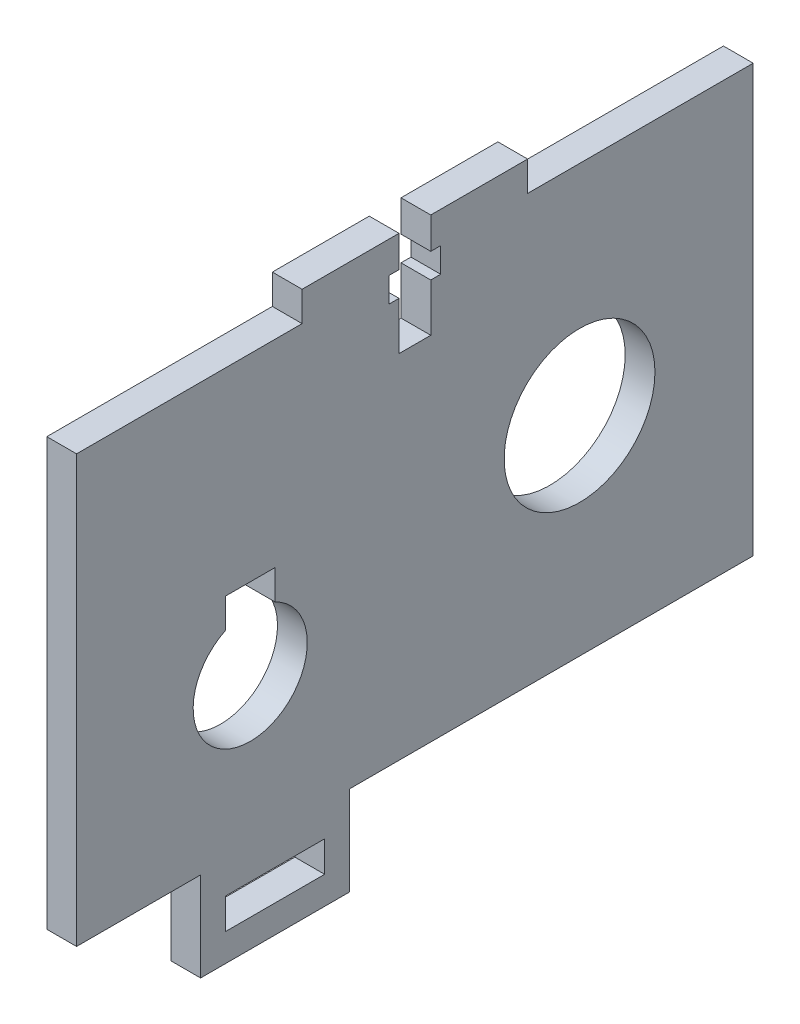
ISO-10303-21;
HEADER;
FILE_DESCRIPTION(('STEP AP214'),'2;1');
FILE_NAME('part.step','',(''),(''),'','','');
FILE_SCHEMA(('AUTOMOTIVE_DESIGN { 1 0 10303 214 1 1 1 1 }'));
ENDSEC;
DATA;
#1=APPLICATION_CONTEXT('core data for automotive mechanical design processes');
#2=APPLICATION_PROTOCOL_DEFINITION('international standard','automotive_design',2000,#1);
#3=PRODUCT_CONTEXT('',#1,'mechanical');
#4=PRODUCT('Part','Part','',(#3));
#5=PRODUCT_RELATED_PRODUCT_CATEGORY('part','',(#4));
#6=PRODUCT_DEFINITION_FORMATION('','',#4);
#7=PRODUCT_DEFINITION_CONTEXT('part definition',#1,'design');
#8=PRODUCT_DEFINITION('design','',#6,#7);
#9=PRODUCT_DEFINITION_SHAPE('','',#8);
#10=(LENGTH_UNIT() NAMED_UNIT(*) SI_UNIT(.MILLI.,.METRE.));
#11=(NAMED_UNIT(*) PLANE_ANGLE_UNIT() SI_UNIT($,.RADIAN.));
#12=(NAMED_UNIT(*) SI_UNIT($,.STERADIAN.) SOLID_ANGLE_UNIT());
#13=UNCERTAINTY_MEASURE_WITH_UNIT(LENGTH_MEASURE(1.E-05),#10,'distance_accuracy_value','');
#14=(GEOMETRIC_REPRESENTATION_CONTEXT(3) GLOBAL_UNCERTAINTY_ASSIGNED_CONTEXT((#13)) GLOBAL_UNIT_ASSIGNED_CONTEXT((#10,
#11,#12)) REPRESENTATION_CONTEXT('',''));
#15=CARTESIAN_POINT('',(0.,0.,0.));
#16=DIRECTION('',(0.,0.,1.));
#17=DIRECTION('',(1.,0.,0.));
#18=AXIS2_PLACEMENT_3D('',#15,#16,#17);
#19=CARTESIAN_POINT('',(3.,46.,0.));
#20=DIRECTION('',(0.,1.,0.));
#21=DIRECTION('',(0.,0.,1.));
#22=AXIS2_PLACEMENT_3D('',#19,#20,#21);
#23=PLANE('',#22);
#24=DIRECTION('',(0.,0.,-1.));
#25=VECTOR('',#24,1.);
#26=CARTESIAN_POINT('',(0.,46.,0.));
#27=LINE('',#26,#25);
#28=CARTESIAN_POINT('',(0.,46.,-35.6968796401613));
#29=VERTEX_POINT('',#28);
#30=CARTESIAN_POINT('',(0.,46.,-45.4625061868818));
#31=VERTEX_POINT('',#30);
#32=EDGE_CURVE('E465',#29,#31,#27,.T.);
#33=ORIENTED_EDGE('',*,*,#32,.F.);
#34=DIRECTION('',(1.,0.,0.));
#35=VECTOR('',#34,1.);
#36=CARTESIAN_POINT('',(0.,46.,-35.6968796401613));
#37=LINE('',#36,#35);
#38=CARTESIAN_POINT('',(3.,46.,-35.6968796401613));
#39=VERTEX_POINT('',#38);
#40=EDGE_CURVE('E320',#29,#39,#37,.T.);
#41=ORIENTED_EDGE('',*,*,#40,.T.);
#42=DIRECTION('',(0.,0.,-1.));
#43=VECTOR('',#42,1.);
#44=CARTESIAN_POINT('',(3.,46.,0.));
#45=LINE('',#44,#43);
#46=CARTESIAN_POINT('',(3.,46.,-45.4625061868818));
#47=VERTEX_POINT('',#46);
#48=EDGE_CURVE('E414',#39,#47,#45,.T.);
#49=ORIENTED_EDGE('',*,*,#48,.T.);
#50=DIRECTION('',(-1.,0.,0.));
#51=VECTOR('',#50,1.);
#52=CARTESIAN_POINT('',(3.,46.,-45.4625061868818));
#53=LINE('',#52,#51);
#54=EDGE_CURVE('E493',#47,#31,#53,.T.);
#55=ORIENTED_EDGE('',*,*,#54,.T.);
#56=EDGE_LOOP('',(#33,#41,#49,#55));
#57=FACE_BOUND('',#56,.T.);
#58=ADVANCED_FACE('F41',(#57),#23,.T.);
#59=CARTESIAN_POINT('',(3.,14.8978,-17.5));
#60=DIRECTION('',(-1.,0.,0.));
#61=DIRECTION('',(0.,0.,1.));
#62=AXIS2_PLACEMENT_3D('',#59,#60,#61);
#63=CYLINDRICAL_SURFACE('',#62,5.75);
#64=CARTESIAN_POINT('',(3.,14.8978,-17.5));
#65=DIRECTION('',(1.,0.,0.));
#66=DIRECTION('',(0.,0.,-1.));
#67=AXIS2_PLACEMENT_3D('',#64,#65,#66);
#68=CIRCLE('',#67,5.75);
#69=CARTESIAN_POINT('',(3.,20.075878794302,-15.));
#70=VERTEX_POINT('',#69);
#71=CARTESIAN_POINT('',(3.000006,20.075878794302,-20.));
#72=VERTEX_POINT('',#71);
#73=EDGE_CURVE('E45',#70,#72,#68,.T.);
#74=ORIENTED_EDGE('',*,*,#73,.T.);
#75=DIRECTION('',(1.,0.,0.));
#76=VECTOR('',#75,1.);
#77=CARTESIAN_POINT('',(0.,20.075878794302,-20.));
#78=LINE('',#77,#76);
#79=CARTESIAN_POINT('',(0.,20.075878794302,-20.));
#80=VERTEX_POINT('',#79);
#81=EDGE_CURVE('E277',#80,#72,#78,.T.);
#82=ORIENTED_EDGE('',*,*,#81,.F.);
#83=CARTESIAN_POINT('',(0.,14.8978,-17.5));
#84=DIRECTION('',(1.,0.,0.));
#85=DIRECTION('',(0.,0.,-1.));
#86=AXIS2_PLACEMENT_3D('',#83,#84,#85);
#87=CIRCLE('',#86,5.75);
#88=CARTESIAN_POINT('',(0.,20.075878794302,-15.));
#89=VERTEX_POINT('',#88);
#90=EDGE_CURVE('E383',#89,#80,#87,.T.);
#91=ORIENTED_EDGE('',*,*,#90,.F.);
#92=DIRECTION('',(1.,0.,0.));
#93=VECTOR('',#92,1.);
#94=CARTESIAN_POINT('',(0.,20.075878794302,-15.));
#95=LINE('',#94,#93);
#96=EDGE_CURVE('E279',#89,#70,#95,.T.);
#97=ORIENTED_EDGE('',*,*,#96,.T.);
#98=EDGE_LOOP('',(#74,#82,#91,#97));
#99=FACE_BOUND('',#98,.T.);
#100=ADVANCED_FACE('F43',(#99),#63,.F.);
#101=CARTESIAN_POINT('',(3.,0.,0.));
#102=DIRECTION('',(1.,0.,0.));
#103=DIRECTION('',(0.,0.,-1.));
#104=AXIS2_PLACEMENT_3D('',#101,#102,#103);
#105=PLANE('',#104);
#106=DIRECTION('',(0.,-1.,0.));
#107=VECTOR('',#106,1.);
#108=CARTESIAN_POINT('',(3.,0.,-32.4968796401613));
#109=LINE('',#108,#107);
#110=CARTESIAN_POINT('',(3.,46.,-32.4968796401613));
#111=VERTEX_POINT('',#110);
#112=CARTESIAN_POINT('',(3.,42.825,-32.4968796401613));
#113=VERTEX_POINT('',#112);
#114=EDGE_CURVE('E368',#111,#113,#109,.T.);
#115=ORIENTED_EDGE('',*,*,#114,.F.);
#116=CARTESIAN_POINT('',(3.,46.,-22.7312530934409));
#117=VERTEX_POINT('',#116);
#118=EDGE_CURVE('E415',#117,#111,#45,.T.);
#119=ORIENTED_EDGE('',*,*,#118,.F.);
#120=DIRECTION('',(0.,-1.,0.));
#121=VECTOR('',#120,1.);
#122=CARTESIAN_POINT('',(3.,0.,-22.7312530934409));
#123=LINE('',#122,#121);
#124=CARTESIAN_POINT('',(3.,43.,-22.7312530934409));
#125=VERTEX_POINT('',#124);
#126=EDGE_CURVE('E418',#117,#125,#123,.T.);
#127=ORIENTED_EDGE('',*,*,#126,.T.);
#128=DIRECTION('',(0.,0.,-1.));
#129=VECTOR('',#128,1.);
#130=CARTESIAN_POINT('',(3.,43.,0.));
#131=LINE('',#130,#129);
#132=CARTESIAN_POINT('',(3.,43.,0.));
#133=VERTEX_POINT('',#132);
#134=EDGE_CURVE('E387',#133,#125,#131,.T.);
#135=ORIENTED_EDGE('',*,*,#134,.F.);
#136=DIRECTION('',(0.,1.,0.));
#137=VECTOR('',#136,1.);
#138=CARTESIAN_POINT('',(3.,0.,0.));
#139=LINE('',#138,#137);
#140=CARTESIAN_POINT('',(3.,0.,0.));
#141=VERTEX_POINT('',#140);
#142=EDGE_CURVE('E390',#141,#133,#139,.T.);
#143=ORIENTED_EDGE('',*,*,#142,.F.);
#144=DIRECTION('',(0.,0.,-1.));
#145=VECTOR('',#144,1.);
#146=CARTESIAN_POINT('',(3.,0.,0.));
#147=LINE('',#146,#145);
#148=CARTESIAN_POINT('',(3.,0.,-12.5));
#149=VERTEX_POINT('',#148);
#150=EDGE_CURVE('E394',#141,#149,#147,.T.);
#151=ORIENTED_EDGE('',*,*,#150,.T.);
#152=DIRECTION('',(0.,-1.,0.));
#153=VECTOR('',#152,1.);
#154=CARTESIAN_POINT('',(3.,0.,-12.5));
#155=LINE('',#154,#153);
#156=CARTESIAN_POINT('',(3.,-9.,-12.5));
#157=VERTEX_POINT('',#156);
#158=EDGE_CURVE('E397',#149,#157,#155,.T.);
#159=ORIENTED_EDGE('',*,*,#158,.T.);
#160=DIRECTION('',(0.,0.,-1.));
#161=VECTOR('',#160,1.);
#162=CARTESIAN_POINT('',(3.,-9.,0.));
#163=LINE('',#162,#161);
#164=CARTESIAN_POINT('',(3.,-9.,-27.5));
#165=VERTEX_POINT('',#164);
#166=EDGE_CURVE('E400',#157,#165,#163,.T.);
#167=ORIENTED_EDGE('',*,*,#166,.T.);
#168=DIRECTION('',(0.,1.,0.));
#169=VECTOR('',#168,1.);
#170=CARTESIAN_POINT('',(3.,0.,-27.5));
#171=LINE('',#170,#169);
#172=CARTESIAN_POINT('',(3.,0.,-27.5));
#173=VERTEX_POINT('',#172);
#174=EDGE_CURVE('E403',#165,#173,#171,.T.);
#175=ORIENTED_EDGE('',*,*,#174,.T.);
#176=DIRECTION('',(0.,0.,-1.));
#177=VECTOR('',#176,1.);
#178=CARTESIAN_POINT('',(3.,0.,0.));
#179=LINE('',#178,#177);
#180=CARTESIAN_POINT('',(3.,0.,-68.1937592803227));
#181=VERTEX_POINT('',#180);
#182=EDGE_CURVE('E406',#173,#181,#179,.T.);
#183=ORIENTED_EDGE('',*,*,#182,.T.);
#184=DIRECTION('',(0.,-1.,0.));
#185=VECTOR('',#184,1.);
#186=CARTESIAN_POINT('',(3.,0.,-68.1937592803227));
#187=LINE('',#186,#185);
#188=CARTESIAN_POINT('',(3.,43.,-68.1937592803227));
#189=VERTEX_POINT('',#188);
#190=EDGE_CURVE('E408',#189,#181,#187,.T.);
#191=ORIENTED_EDGE('',*,*,#190,.F.);
#192=CARTESIAN_POINT('',(3.,43.,-45.4625061868818));
#193=VERTEX_POINT('',#192);
#194=EDGE_CURVE('E391',#193,#189,#131,.T.);
#195=ORIENTED_EDGE('',*,*,#194,.F.);
#196=DIRECTION('',(0.,1.,0.));
#197=VECTOR('',#196,1.);
#198=CARTESIAN_POINT('',(3.,0.,-45.4625061868818));
#199=LINE('',#198,#197);
#200=EDGE_CURVE('E411',#193,#47,#199,.T.);
#201=ORIENTED_EDGE('',*,*,#200,.T.);
#202=ORIENTED_EDGE('',*,*,#48,.F.);
#203=DIRECTION('',(0.,-1.,0.));
#204=VECTOR('',#203,1.);
#205=CARTESIAN_POINT('',(3.,0.,-35.6968796401613));
#206=LINE('',#205,#204);
#207=CARTESIAN_POINT('',(3.,42.825,-35.6968796401613));
#208=VERTEX_POINT('',#207);
#209=EDGE_CURVE('E365',#39,#208,#206,.T.);
#210=ORIENTED_EDGE('',*,*,#209,.T.);
#211=DIRECTION('',(0.,0.,-1.));
#212=VECTOR('',#211,1.);
#213=CARTESIAN_POINT('',(3.,42.825,0.));
#214=LINE('',#213,#212);
#215=CARTESIAN_POINT('',(3.,42.825,-36.6968796401613));
#216=VERTEX_POINT('',#215);
#217=EDGE_CURVE('E362',#208,#216,#214,.T.);
#218=ORIENTED_EDGE('',*,*,#217,.T.);
#219=DIRECTION('',(0.,1.,0.));
#220=VECTOR('',#219,1.);
#221=CARTESIAN_POINT('',(3.,0.,-36.6968796401613));
#222=LINE('',#221,#220);
#223=CARTESIAN_POINT('',(3.,40.325,-36.6968796401613));
#224=VERTEX_POINT('',#223);
#225=EDGE_CURVE('E360',#224,#216,#222,.T.);
#226=ORIENTED_EDGE('',*,*,#225,.F.);
#227=DIRECTION('',(0.,0.,-1.));
#228=VECTOR('',#227,1.);
#229=CARTESIAN_POINT('',(3.,40.325,0.));
#230=LINE('',#229,#228);
#231=CARTESIAN_POINT('',(3.,40.325,-35.6968796401613));
#232=VERTEX_POINT('',#231);
#233=EDGE_CURVE('E356',#232,#224,#230,.T.);
#234=ORIENTED_EDGE('',*,*,#233,.F.);
#235=DIRECTION('',(0.,-1.,0.));
#236=VECTOR('',#235,1.);
#237=CARTESIAN_POINT('',(3.,0.,-35.6968796401613));
#238=LINE('',#237,#236);
#239=CARTESIAN_POINT('',(3.,35.5,-35.6968796401613));
#240=VERTEX_POINT('',#239);
#241=EDGE_CURVE('E260',#232,#240,#238,.T.);
#242=ORIENTED_EDGE('',*,*,#241,.T.);
#243=DIRECTION('',(0.,0.,-1.));
#244=VECTOR('',#243,1.);
#245=CARTESIAN_POINT('',(3.,35.5,0.));
#246=LINE('',#245,#244);
#247=CARTESIAN_POINT('',(3.,35.5,-32.4968796401613));
#248=VERTEX_POINT('',#247);
#249=EDGE_CURVE('E380',#248,#240,#246,.T.);
#250=ORIENTED_EDGE('',*,*,#249,.F.);
#251=DIRECTION('',(0.,-1.,0.));
#252=VECTOR('',#251,1.);
#253=CARTESIAN_POINT('',(3.,0.,-32.4968796401613));
#254=LINE('',#253,#252);
#255=CARTESIAN_POINT('',(3.,40.325,-32.4968796401613));
#256=VERTEX_POINT('',#255);
#257=EDGE_CURVE('E378',#256,#248,#254,.T.);
#258=ORIENTED_EDGE('',*,*,#257,.F.);
#259=DIRECTION('',(0.,0.,-1.));
#260=VECTOR('',#259,1.);
#261=CARTESIAN_POINT('',(3.,40.325,0.));
#262=LINE('',#261,#260);
#263=CARTESIAN_POINT('',(3.,40.325,-31.4968796401613));
#264=VERTEX_POINT('',#263);
#265=EDGE_CURVE('E376',#264,#256,#262,.T.);
#266=ORIENTED_EDGE('',*,*,#265,.F.);
#267=DIRECTION('',(0.,1.,0.));
#268=VECTOR('',#267,1.);
#269=CARTESIAN_POINT('',(3.,0.,-31.4968796401613));
#270=LINE('',#269,#268);
#271=CARTESIAN_POINT('',(3.,42.825,-31.4968796401613));
#272=VERTEX_POINT('',#271);
#273=EDGE_CURVE('E373',#264,#272,#270,.T.);
#274=ORIENTED_EDGE('',*,*,#273,.T.);
#275=DIRECTION('',(0.,0.,-1.));
#276=VECTOR('',#275,1.);
#277=CARTESIAN_POINT('',(3.,42.825,0.));
#278=LINE('',#277,#276);
#279=EDGE_CURVE('E370',#272,#113,#278,.T.);
#280=ORIENTED_EDGE('',*,*,#279,.T.);
#281=EDGE_LOOP('',(#115,#119,#127,#135,#143,#151,#159,#167,#175,#183,#191,#195,#201,#202,#210,
#218,#226,#234,#242,#250,#258,#266,#274,#280));
#282=FACE_BOUND('',#281,.T.);
#283=CARTESIAN_POINT('',(3.,21.,-50.6937592803227));
#284=DIRECTION('',(1.,0.,0.));
#285=DIRECTION('',(0.,0.,-1.));
#286=AXIS2_PLACEMENT_3D('',#283,#284,#285);
#287=CIRCLE('',#286,7.6);
#288=CARTESIAN_POINT('',(3.,21.,-58.2937592803227));
#289=VERTEX_POINT('',#288);
#290=EDGE_CURVE('E384',#289,#289,#287,.T.);
#291=ORIENTED_EDGE('',*,*,#290,.F.);
#292=EDGE_LOOP('',(#291));
#293=FACE_BOUND('',#292,.T.);
#294=DIRECTION('',(0.,1.,0.));
#295=VECTOR('',#294,1.);
#296=CARTESIAN_POINT('',(3.,0.,-25.));
#297=LINE('',#296,#295);
#298=CARTESIAN_POINT('',(3.,-6.2,-25.));
#299=VERTEX_POINT('',#298);
#300=CARTESIAN_POINT('',(3.,-3.1,-25.));
#301=VERTEX_POINT('',#300);
#302=EDGE_CURVE('E420',#299,#301,#297,.T.);
#303=ORIENTED_EDGE('',*,*,#302,.F.);
#304=DIRECTION('',(0.,0.,-1.));
#305=VECTOR('',#304,1.);
#306=CARTESIAN_POINT('',(3.,-6.2,0.));
#307=LINE('',#306,#305);
#308=CARTESIAN_POINT('',(3.,-6.2,-15.));
#309=VERTEX_POINT('',#308);
#310=EDGE_CURVE('E423',#309,#299,#307,.T.);
#311=ORIENTED_EDGE('',*,*,#310,.F.);
#312=DIRECTION('',(0.,1.,0.));
#313=VECTOR('',#312,1.);
#314=CARTESIAN_POINT('',(3.,0.,-15.));
#315=LINE('',#314,#313);
#316=CARTESIAN_POINT('',(3.,-3.1,-15.));
#317=VERTEX_POINT('',#316);
#318=EDGE_CURVE('E426',#309,#317,#315,.T.);
#319=ORIENTED_EDGE('',*,*,#318,.T.);
#320=DIRECTION('',(0.,0.,-1.));
#321=VECTOR('',#320,1.);
#322=CARTESIAN_POINT('',(3.,-3.1,0.));
#323=LINE('',#322,#321);
#324=EDGE_CURVE('E429',#317,#301,#323,.T.);
#325=ORIENTED_EDGE('',*,*,#324,.T.);
#326=EDGE_LOOP('',(#303,#311,#319,#325));
#327=FACE_BOUND('',#326,.T.);
#328=DIRECTION('',(0.,0.,-1.));
#329=VECTOR('',#328,1.);
#330=CARTESIAN_POINT('',(3.,23.075878794302,0.));
#331=LINE('',#330,#329);
#332=CARTESIAN_POINT('',(3.,23.075878794302,-15.));
#333=VERTEX_POINT('',#332);
#334=CARTESIAN_POINT('',(3.,23.075878794302,-20.));
#335=VERTEX_POINT('',#334);
#336=EDGE_CURVE('E302',#333,#335,#331,.T.);
#337=ORIENTED_EDGE('',*,*,#336,.T.);
#338=DIRECTION('',(0.,-1.,0.));
#339=VECTOR('',#338,1.);
#340=CARTESIAN_POINT('',(3.,0.,-20.));
#341=LINE('',#340,#339);
#342=EDGE_CURVE('E351',#335,#72,#341,.T.);
#343=ORIENTED_EDGE('',*,*,#342,.T.);
#344=ORIENTED_EDGE('',*,*,#73,.F.);
#345=DIRECTION('',(0.,1.,0.));
#346=VECTOR('',#345,1.);
#347=CARTESIAN_POINT('',(3.,0.,-15.));
#348=LINE('',#347,#346);
#349=EDGE_CURVE('E348',#70,#333,#348,.T.);
#350=ORIENTED_EDGE('',*,*,#349,.T.);
#351=EDGE_LOOP('',(#337,#343,#344,#350));
#352=FACE_BOUND('',#351,.T.);
#353=ADVANCED_FACE('F534',(#282,#293,#327,#352),#105,.T.);
#354=CARTESIAN_POINT('',(0.,0.,0.));
#355=DIRECTION('',(1.,0.,0.));
#356=DIRECTION('',(0.,0.,-1.));
#357=AXIS2_PLACEMENT_3D('',#354,#355,#356);
#358=PLANE('',#357);
#359=DIRECTION('',(0.,1.,0.));
#360=VECTOR('',#359,1.);
#361=CARTESIAN_POINT('',(0.,0.,-25.));
#362=LINE('',#361,#360);
#363=CARTESIAN_POINT('',(0.,-6.2,-25.));
#364=VERTEX_POINT('',#363);
#365=CARTESIAN_POINT('',(0.,-3.1,-25.));
#366=VERTEX_POINT('',#365);
#367=EDGE_CURVE('E471',#364,#366,#362,.T.);
#368=ORIENTED_EDGE('',*,*,#367,.T.);
#369=DIRECTION('',(0.,0.,-1.));
#370=VECTOR('',#369,1.);
#371=CARTESIAN_POINT('',(0.,-3.1,0.));
#372=LINE('',#371,#370);
#373=CARTESIAN_POINT('',(0.,-3.1,-15.));
#374=VERTEX_POINT('',#373);
#375=EDGE_CURVE('E480',#374,#366,#372,.T.);
#376=ORIENTED_EDGE('',*,*,#375,.F.);
#377=DIRECTION('',(0.,1.,0.));
#378=VECTOR('',#377,1.);
#379=CARTESIAN_POINT('',(0.,0.,-15.));
#380=LINE('',#379,#378);
#381=CARTESIAN_POINT('',(0.,-6.2,-15.));
#382=VERTEX_POINT('',#381);
#383=EDGE_CURVE('E477',#382,#374,#380,.T.);
#384=ORIENTED_EDGE('',*,*,#383,.F.);
#385=DIRECTION('',(0.,0.,-1.));
#386=VECTOR('',#385,1.);
#387=CARTESIAN_POINT('',(0.,-6.2,0.));
#388=LINE('',#387,#386);
#389=EDGE_CURVE('E474',#382,#364,#388,.T.);
#390=ORIENTED_EDGE('',*,*,#389,.T.);
#391=EDGE_LOOP('',(#368,#376,#384,#390));
#392=FACE_BOUND('',#391,.T.);
#393=CARTESIAN_POINT('',(0.,46.,-22.7312530934409));
#394=VERTEX_POINT('',#393);
#395=CARTESIAN_POINT('',(0.,46.,-32.4968796401613));
#396=VERTEX_POINT('',#395);
#397=EDGE_CURVE('E466',#394,#396,#27,.T.);
#398=ORIENTED_EDGE('',*,*,#397,.T.);
#399=DIRECTION('',(0.,-1.,0.));
#400=VECTOR('',#399,1.);
#401=CARTESIAN_POINT('',(0.,0.,-32.4968796401613));
#402=LINE('',#401,#400);
#403=CARTESIAN_POINT('',(0.,42.825,-32.4968796401613));
#404=VERTEX_POINT('',#403);
#405=EDGE_CURVE('E287',#396,#404,#402,.T.);
#406=ORIENTED_EDGE('',*,*,#405,.T.);
#407=DIRECTION('',(0.,0.,-1.));
#408=VECTOR('',#407,1.);
#409=CARTESIAN_POINT('',(0.,42.825,0.));
#410=LINE('',#409,#408);
#411=CARTESIAN_POINT('',(0.,42.825,-31.4968796401613));
#412=VERTEX_POINT('',#411);
#413=EDGE_CURVE('E290',#412,#404,#410,.T.);
#414=ORIENTED_EDGE('',*,*,#413,.F.);
#415=DIRECTION('',(0.,1.,0.));
#416=VECTOR('',#415,1.);
#417=CARTESIAN_POINT('',(0.,0.,-31.4968796401613));
#418=LINE('',#417,#416);
#419=CARTESIAN_POINT('',(0.,40.325,-31.4968796401613));
#420=VERTEX_POINT('',#419);
#421=EDGE_CURVE('E292',#420,#412,#418,.T.);
#422=ORIENTED_EDGE('',*,*,#421,.F.);
#423=DIRECTION('',(0.,0.,-1.));
#424=VECTOR('',#423,1.);
#425=CARTESIAN_POINT('',(0.,40.325,0.));
#426=LINE('',#425,#424);
#427=CARTESIAN_POINT('',(0.,40.325,-32.4968796401613));
#428=VERTEX_POINT('',#427);
#429=EDGE_CURVE('E294',#420,#428,#426,.T.);
#430=ORIENTED_EDGE('',*,*,#429,.T.);
#431=DIRECTION('',(0.,-1.,0.));
#432=VECTOR('',#431,1.);
#433=CARTESIAN_POINT('',(0.,0.,-32.4968796401613));
#434=LINE('',#433,#432);
#435=CARTESIAN_POINT('',(0.,35.5,-32.4968796401613));
#436=VERTEX_POINT('',#435);
#437=EDGE_CURVE('E297',#428,#436,#434,.T.);
#438=ORIENTED_EDGE('',*,*,#437,.T.);
#439=DIRECTION('',(0.,0.,-1.));
#440=VECTOR('',#439,1.);
#441=CARTESIAN_POINT('',(0.,35.5,0.));
#442=LINE('',#441,#440);
#443=CARTESIAN_POINT('',(0.,35.5,-35.6968796401613));
#444=VERTEX_POINT('',#443);
#445=EDGE_CURVE('E264',#436,#444,#442,.T.);
#446=ORIENTED_EDGE('',*,*,#445,.T.);
#447=DIRECTION('',(0.,-1.,0.));
#448=VECTOR('',#447,1.);
#449=CARTESIAN_POINT('',(0.,0.,-35.6968796401613));
#450=LINE('',#449,#448);
#451=CARTESIAN_POINT('',(0.,40.325,-35.6968796401613));
#452=VERTEX_POINT('',#451);
#453=EDGE_CURVE('E257',#452,#444,#450,.T.);
#454=ORIENTED_EDGE('',*,*,#453,.F.);
#455=DIRECTION('',(0.,0.,-1.));
#456=VECTOR('',#455,1.);
#457=CARTESIAN_POINT('',(0.,40.325,0.));
#458=LINE('',#457,#456);
#459=CARTESIAN_POINT('',(0.,40.325,-36.6968796401613));
#460=VERTEX_POINT('',#459);
#461=EDGE_CURVE('E267',#452,#460,#458,.T.);
#462=ORIENTED_EDGE('',*,*,#461,.T.);
#463=DIRECTION('',(0.,1.,0.));
#464=VECTOR('',#463,1.);
#465=CARTESIAN_POINT('',(0.,0.,-36.6968796401613));
#466=LINE('',#465,#464);
#467=CARTESIAN_POINT('',(0.,42.825,-36.6968796401613));
#468=VERTEX_POINT('',#467);
#469=EDGE_CURVE('E58',#460,#468,#466,.T.);
#470=ORIENTED_EDGE('',*,*,#469,.T.);
#471=DIRECTION('',(0.,0.,-1.));
#472=VECTOR('',#471,1.);
#473=CARTESIAN_POINT('',(0.,42.825,0.));
#474=LINE('',#473,#472);
#475=CARTESIAN_POINT('',(0.,42.825,-35.6968796401613));
#476=VERTEX_POINT('',#475);
#477=EDGE_CURVE('E283',#476,#468,#474,.T.);
#478=ORIENTED_EDGE('',*,*,#477,.F.);
#479=DIRECTION('',(0.,-1.,0.));
#480=VECTOR('',#479,1.);
#481=CARTESIAN_POINT('',(0.,0.,-35.6968796401613));
#482=LINE('',#481,#480);
#483=EDGE_CURVE('E285',#29,#476,#482,.T.);
#484=ORIENTED_EDGE('',*,*,#483,.F.);
#485=ORIENTED_EDGE('',*,*,#32,.T.);
#486=DIRECTION('',(0.,1.,0.));
#487=VECTOR('',#486,1.);
#488=CARTESIAN_POINT('',(0.,0.,-45.4625061868818));
#489=LINE('',#488,#487);
#490=CARTESIAN_POINT('',(0.,43.,-45.4625061868818));
#491=VERTEX_POINT('',#490);
#492=EDGE_CURVE('E462',#491,#31,#489,.T.);
#493=ORIENTED_EDGE('',*,*,#492,.F.);
#494=DIRECTION('',(0.,0.,-1.));
#495=VECTOR('',#494,1.);
#496=CARTESIAN_POINT('',(0.,43.,0.));
#497=LINE('',#496,#495);
#498=CARTESIAN_POINT('',(0.,43.,-68.1937592803227));
#499=VERTEX_POINT('',#498);
#500=EDGE_CURVE('E441',#491,#499,#497,.T.);
#501=ORIENTED_EDGE('',*,*,#500,.T.);
#502=DIRECTION('',(0.,-1.,0.));
#503=VECTOR('',#502,1.);
#504=CARTESIAN_POINT('',(0.,0.,-68.1937592803227));
#505=LINE('',#504,#503);
#506=CARTESIAN_POINT('',(0.,0.,-68.1937592803227));
#507=VERTEX_POINT('',#506);
#508=EDGE_CURVE('E459',#499,#507,#505,.T.);
#509=ORIENTED_EDGE('',*,*,#508,.T.);
#510=DIRECTION('',(0.,0.,-1.));
#511=VECTOR('',#510,1.);
#512=CARTESIAN_POINT('',(0.,0.,0.));
#513=LINE('',#512,#511);
#514=CARTESIAN_POINT('',(0.,0.,-27.5));
#515=VERTEX_POINT('',#514);
#516=EDGE_CURVE('E456',#515,#507,#513,.T.);
#517=ORIENTED_EDGE('',*,*,#516,.F.);
#518=DIRECTION('',(0.,1.,0.));
#519=VECTOR('',#518,1.);
#520=CARTESIAN_POINT('',(0.,0.,-27.5));
#521=LINE('',#520,#519);
#522=CARTESIAN_POINT('',(0.,-9.,-27.5));
#523=VERTEX_POINT('',#522);
#524=EDGE_CURVE('E453',#523,#515,#521,.T.);
#525=ORIENTED_EDGE('',*,*,#524,.F.);
#526=DIRECTION('',(0.,0.,-1.));
#527=VECTOR('',#526,1.);
#528=CARTESIAN_POINT('',(0.,-9.,0.));
#529=LINE('',#528,#527);
#530=CARTESIAN_POINT('',(0.,-9.,-12.5));
#531=VERTEX_POINT('',#530);
#532=EDGE_CURVE('E450',#531,#523,#529,.T.);
#533=ORIENTED_EDGE('',*,*,#532,.F.);
#534=DIRECTION('',(0.,-1.,0.));
#535=VECTOR('',#534,1.);
#536=CARTESIAN_POINT('',(0.,0.,-12.5));
#537=LINE('',#536,#535);
#538=CARTESIAN_POINT('',(0.,0.,-12.5));
#539=VERTEX_POINT('',#538);
#540=EDGE_CURVE('E447',#539,#531,#537,.T.);
#541=ORIENTED_EDGE('',*,*,#540,.F.);
#542=DIRECTION('',(0.,0.,-1.));
#543=VECTOR('',#542,1.);
#544=CARTESIAN_POINT('',(0.,0.,0.));
#545=LINE('',#544,#543);
#546=CARTESIAN_POINT('',(0.,0.,0.));
#547=VERTEX_POINT('',#546);
#548=EDGE_CURVE('E444',#547,#539,#545,.T.);
#549=ORIENTED_EDGE('',*,*,#548,.F.);
#550=DIRECTION('',(0.,1.,0.));
#551=VECTOR('',#550,1.);
#552=CARTESIAN_POINT('',(0.,0.,0.));
#553=LINE('',#552,#551);
#554=CARTESIAN_POINT('',(0.,43.,0.));
#555=VERTEX_POINT('',#554);
#556=EDGE_CURVE('E440',#547,#555,#553,.T.);
#557=ORIENTED_EDGE('',*,*,#556,.T.);
#558=CARTESIAN_POINT('',(0.,43.,-22.7312530934409));
#559=VERTEX_POINT('',#558);
#560=EDGE_CURVE('E437',#555,#559,#497,.T.);
#561=ORIENTED_EDGE('',*,*,#560,.T.);
#562=DIRECTION('',(0.,-1.,0.));
#563=VECTOR('',#562,1.);
#564=CARTESIAN_POINT('',(0.,0.,-22.7312530934409));
#565=LINE('',#564,#563);
#566=EDGE_CURVE('E468',#394,#559,#565,.T.);
#567=ORIENTED_EDGE('',*,*,#566,.F.);
#568=EDGE_LOOP('',(#398,#406,#414,#422,#430,#438,#446,#454,#462,#470,#478,#484,#485,#493,#501,
#509,#517,#525,#533,#541,#549,#557,#561,#567));
#569=FACE_BOUND('',#568,.T.);
#570=CARTESIAN_POINT('',(0.,21.,-50.6937592803227));
#571=DIRECTION('',(1.,0.,0.));
#572=DIRECTION('',(0.,0.,-1.));
#573=AXIS2_PLACEMENT_3D('',#570,#571,#572);
#574=CIRCLE('',#573,7.6);
#575=CARTESIAN_POINT('',(0.,21.,-58.2937592803227));
#576=VERTEX_POINT('',#575);
#577=EDGE_CURVE('E434',#576,#576,#574,.T.);
#578=ORIENTED_EDGE('',*,*,#577,.T.);
#579=EDGE_LOOP('',(#578));
#580=FACE_BOUND('',#579,.T.);
#581=DIRECTION('',(0.,-1.,0.));
#582=VECTOR('',#581,1.);
#583=CARTESIAN_POINT('',(0.,0.,-20.));
#584=LINE('',#583,#582);
#585=CARTESIAN_POINT('',(0.,23.075878794302,-20.));
#586=VERTEX_POINT('',#585);
#587=EDGE_CURVE('E330',#586,#80,#584,.T.);
#588=ORIENTED_EDGE('',*,*,#587,.F.);
#589=DIRECTION('',(0.,0.,-1.));
#590=VECTOR('',#589,1.);
#591=CARTESIAN_POINT('',(0.,23.075878794302,0.));
#592=LINE('',#591,#590);
#593=CARTESIAN_POINT('',(0.,23.075878794302,-15.));
#594=VERTEX_POINT('',#593);
#595=EDGE_CURVE('E332',#594,#586,#592,.T.);
#596=ORIENTED_EDGE('',*,*,#595,.F.);
#597=DIRECTION('',(0.,1.,0.));
#598=VECTOR('',#597,1.);
#599=CARTESIAN_POINT('',(0.,0.,-15.));
#600=LINE('',#599,#598);
#601=EDGE_CURVE('E334',#89,#594,#600,.T.);
#602=ORIENTED_EDGE('',*,*,#601,.F.);
#603=ORIENTED_EDGE('',*,*,#90,.T.);
#604=EDGE_LOOP('',(#588,#596,#602,#603));
#605=FACE_BOUND('',#604,.T.);
#606=ADVANCED_FACE('F273',(#392,#569,#580,#605),#358,.F.);
#607=CARTESIAN_POINT('',(3.,0.,-25.));
#608=DIRECTION('',(0.,0.,1.));
#609=DIRECTION('',(1.,0.,0.));
#610=AXIS2_PLACEMENT_3D('',#607,#608,#609);
#611=PLANE('',#610);
#612=ORIENTED_EDGE('',*,*,#367,.F.);
#613=DIRECTION('',(-1.,0.,0.));
#614=VECTOR('',#613,1.);
#615=CARTESIAN_POINT('',(3.,-6.2,-25.));
#616=LINE('',#615,#614);
#617=EDGE_CURVE('E11',#299,#364,#616,.T.);
#618=ORIENTED_EDGE('',*,*,#617,.F.);
#619=ORIENTED_EDGE('',*,*,#302,.T.);
#620=DIRECTION('',(-1.,0.,0.));
#621=VECTOR('',#620,1.);
#622=CARTESIAN_POINT('',(3.,-3.1,-25.));
#623=LINE('',#622,#621);
#624=EDGE_CURVE('E483',#301,#366,#623,.T.);
#625=ORIENTED_EDGE('',*,*,#624,.T.);
#626=EDGE_LOOP('',(#612,#618,#619,#625));
#627=FACE_BOUND('',#626,.T.);
#628=ADVANCED_FACE('F622',(#627),#611,.T.);
#629=CARTESIAN_POINT('',(3.,-6.2,0.));
#630=DIRECTION('',(0.,1.,0.));
#631=DIRECTION('',(0.,0.,1.));
#632=AXIS2_PLACEMENT_3D('',#629,#630,#631);
#633=PLANE('',#632);
#634=ORIENTED_EDGE('',*,*,#389,.F.);
#635=DIRECTION('',(-1.,0.,0.));
#636=VECTOR('',#635,1.);
#637=CARTESIAN_POINT('',(3.,-6.2,-15.));
#638=LINE('',#637,#636);
#639=EDGE_CURVE('E50',#309,#382,#638,.T.);
#640=ORIENTED_EDGE('',*,*,#639,.F.);
#641=ORIENTED_EDGE('',*,*,#310,.T.);
#642=ORIENTED_EDGE('',*,*,#617,.T.);
#643=EDGE_LOOP('',(#634,#640,#641,#642));
#644=FACE_BOUND('',#643,.T.);
#645=ADVANCED_FACE('F625',(#644),#633,.T.);
#646=CARTESIAN_POINT('',(3.,0.,-15.));
#647=DIRECTION('',(0.,0.,1.));
#648=DIRECTION('',(0.,-1.,0.));
#649=AXIS2_PLACEMENT_3D('',#646,#647,#648);
#650=PLANE('',#649);
#651=ORIENTED_EDGE('',*,*,#383,.T.);
#652=DIRECTION('',(-1.,0.,0.));
#653=VECTOR('',#652,1.);
#654=CARTESIAN_POINT('',(3.,-3.1,-15.));
#655=LINE('',#654,#653);
#656=EDGE_CURVE('E485',#317,#374,#655,.T.);
#657=ORIENTED_EDGE('',*,*,#656,.F.);
#658=ORIENTED_EDGE('',*,*,#318,.F.);
#659=ORIENTED_EDGE('',*,*,#639,.T.);
#660=EDGE_LOOP('',(#651,#657,#658,#659));
#661=FACE_BOUND('',#660,.T.);
#662=ADVANCED_FACE('F629',(#661),#650,.F.);
#663=CARTESIAN_POINT('',(3.,43.,0.));
#664=DIRECTION('',(0.,1.,0.));
#665=DIRECTION('',(0.,0.,1.));
#666=AXIS2_PLACEMENT_3D('',#663,#664,#665);
#667=PLANE('',#666);
#668=ORIENTED_EDGE('',*,*,#560,.F.);
#669=DIRECTION('',(-1.,0.,0.));
#670=VECTOR('',#669,1.);
#671=CARTESIAN_POINT('',(3.,43.,0.));
#672=LINE('',#671,#670);
#673=EDGE_CURVE('E486',#133,#555,#672,.T.);
#674=ORIENTED_EDGE('',*,*,#673,.F.);
#675=ORIENTED_EDGE('',*,*,#134,.T.);
#676=DIRECTION('',(-1.,0.,0.));
#677=VECTOR('',#676,1.);
#678=CARTESIAN_POINT('',(3.,43.,-22.7312530934409));
#679=LINE('',#678,#677);
#680=EDGE_CURVE('E431',#125,#559,#679,.T.);
#681=ORIENTED_EDGE('',*,*,#680,.T.);
#682=EDGE_LOOP('',(#668,#674,#675,#681));
#683=FACE_BOUND('',#682,.T.);
#684=ADVANCED_FACE('F524',(#683),#667,.T.);
#685=CARTESIAN_POINT('',(3.,0.,0.));
#686=DIRECTION('',(0.,0.,1.));
#687=DIRECTION('',(1.,0.,0.));
#688=AXIS2_PLACEMENT_3D('',#685,#686,#687);
#689=PLANE('',#688);
#690=ORIENTED_EDGE('',*,*,#556,.F.);
#691=DIRECTION('',(-1.,0.,0.));
#692=VECTOR('',#691,1.);
#693=CARTESIAN_POINT('',(3.,0.,0.));
#694=LINE('',#693,#692);
#695=EDGE_CURVE('E514',#141,#547,#694,.T.);
#696=ORIENTED_EDGE('',*,*,#695,.F.);
#697=ORIENTED_EDGE('',*,*,#142,.T.);
#698=ORIENTED_EDGE('',*,*,#673,.T.);
#699=EDGE_LOOP('',(#690,#696,#697,#698));
#700=FACE_BOUND('',#699,.T.);
#701=ADVANCED_FACE('F520',(#700),#689,.T.);
#702=CARTESIAN_POINT('',(3.,0.,0.));
#703=DIRECTION('',(0.,1.,0.));
#704=DIRECTION('',(0.,0.,1.));
#705=AXIS2_PLACEMENT_3D('',#702,#703,#704);
#706=PLANE('',#705);
#707=ORIENTED_EDGE('',*,*,#548,.T.);
#708=DIRECTION('',(-1.,0.,0.));
#709=VECTOR('',#708,1.);
#710=CARTESIAN_POINT('',(3.,0.,-12.5));
#711=LINE('',#710,#709);
#712=EDGE_CURVE('E511',#149,#539,#711,.T.);
#713=ORIENTED_EDGE('',*,*,#712,.F.);
#714=ORIENTED_EDGE('',*,*,#150,.F.);
#715=ORIENTED_EDGE('',*,*,#695,.T.);
#716=EDGE_LOOP('',(#707,#713,#714,#715));
#717=FACE_BOUND('',#716,.T.);
#718=ADVANCED_FACE('F530',(#717),#706,.F.);
#719=CARTESIAN_POINT('',(3.,0.,-12.5));
#720=DIRECTION('',(0.,0.,-1.));
#721=DIRECTION('',(-1.,0.,0.));
#722=AXIS2_PLACEMENT_3D('',#719,#720,#721);
#723=PLANE('',#722);
#724=ORIENTED_EDGE('',*,*,#540,.T.);
#725=DIRECTION('',(-1.,0.,0.));
#726=VECTOR('',#725,1.);
#727=CARTESIAN_POINT('',(3.,-9.,-12.5));
#728=LINE('',#727,#726);
#729=EDGE_CURVE('E508',#157,#531,#728,.T.);
#730=ORIENTED_EDGE('',*,*,#729,.F.);
#731=ORIENTED_EDGE('',*,*,#158,.F.);
#732=ORIENTED_EDGE('',*,*,#712,.T.);
#733=EDGE_LOOP('',(#724,#730,#731,#732));
#734=FACE_BOUND('',#733,.T.);
#735=ADVANCED_FACE('F602',(#734),#723,.F.);
#736=CARTESIAN_POINT('',(3.,-9.,0.));
#737=DIRECTION('',(0.,1.,0.));
#738=DIRECTION('',(0.,0.,1.));
#739=AXIS2_PLACEMENT_3D('',#736,#737,#738);
#740=PLANE('',#739);
#741=ORIENTED_EDGE('',*,*,#532,.T.);
#742=DIRECTION('',(-1.,0.,0.));
#743=VECTOR('',#742,1.);
#744=CARTESIAN_POINT('',(3.,-9.,-27.5));
#745=LINE('',#744,#743);
#746=EDGE_CURVE('E505',#165,#523,#745,.T.);
#747=ORIENTED_EDGE('',*,*,#746,.F.);
#748=ORIENTED_EDGE('',*,*,#166,.F.);
#749=ORIENTED_EDGE('',*,*,#729,.T.);
#750=EDGE_LOOP('',(#741,#747,#748,#749));
#751=FACE_BOUND('',#750,.T.);
#752=ADVANCED_FACE('F599',(#751),#740,.F.);
#753=CARTESIAN_POINT('',(3.,0.,-27.5));
#754=DIRECTION('',(0.,0.,1.));
#755=DIRECTION('',(0.,-1.,0.));
#756=AXIS2_PLACEMENT_3D('',#753,#754,#755);
#757=PLANE('',#756);
#758=ORIENTED_EDGE('',*,*,#524,.T.);
#759=DIRECTION('',(-1.,0.,0.));
#760=VECTOR('',#759,1.);
#761=CARTESIAN_POINT('',(3.,0.,-27.5));
#762=LINE('',#761,#760);
#763=EDGE_CURVE('E502',#173,#515,#762,.T.);
#764=ORIENTED_EDGE('',*,*,#763,.F.);
#765=ORIENTED_EDGE('',*,*,#174,.F.);
#766=ORIENTED_EDGE('',*,*,#746,.T.);
#767=EDGE_LOOP('',(#758,#764,#765,#766));
#768=FACE_BOUND('',#767,.T.);
#769=ADVANCED_FACE('F596',(#768),#757,.F.);
#770=CARTESIAN_POINT('',(3.,0.,0.));
#771=DIRECTION('',(0.,1.,0.));
#772=DIRECTION('',(0.,0.,1.));
#773=AXIS2_PLACEMENT_3D('',#770,#771,#772);
#774=PLANE('',#773);
#775=ORIENTED_EDGE('',*,*,#516,.T.);
#776=DIRECTION('',(-1.,0.,0.));
#777=VECTOR('',#776,1.);
#778=CARTESIAN_POINT('',(3.,0.,-68.1937592803227));
#779=LINE('',#778,#777);
#780=EDGE_CURVE('E500',#181,#507,#779,.T.);
#781=ORIENTED_EDGE('',*,*,#780,.F.);
#782=ORIENTED_EDGE('',*,*,#182,.F.);
#783=ORIENTED_EDGE('',*,*,#763,.T.);
#784=EDGE_LOOP('',(#775,#781,#782,#783));
#785=FACE_BOUND('',#784,.T.);
#786=ADVANCED_FACE('F594',(#785),#774,.F.);
#787=CARTESIAN_POINT('',(3.,0.,-68.1937592803227));
#788=DIRECTION('',(0.,0.,-1.));
#789=DIRECTION('',(-1.,0.,0.));
#790=AXIS2_PLACEMENT_3D('',#787,#788,#789);
#791=PLANE('',#790);
#792=ORIENTED_EDGE('',*,*,#508,.F.);
#793=DIRECTION('',(-1.,0.,0.));
#794=VECTOR('',#793,1.);
#795=CARTESIAN_POINT('',(3.,43.,-68.1937592803227));
#796=LINE('',#795,#794);
#797=EDGE_CURVE('E498',#189,#499,#796,.T.);
#798=ORIENTED_EDGE('',*,*,#797,.F.);
#799=ORIENTED_EDGE('',*,*,#190,.T.);
#800=ORIENTED_EDGE('',*,*,#780,.T.);
#801=EDGE_LOOP('',(#792,#798,#799,#800));
#802=FACE_BOUND('',#801,.T.);
#803=ADVANCED_FACE('F590',(#802),#791,.T.);
#804=ORIENTED_EDGE('',*,*,#500,.F.);
#805=DIRECTION('',(-1.,0.,0.));
#806=VECTOR('',#805,1.);
#807=CARTESIAN_POINT('',(3.,43.,-45.4625061868818));
#808=LINE('',#807,#806);
#809=EDGE_CURVE('E496',#193,#491,#808,.T.);
#810=ORIENTED_EDGE('',*,*,#809,.F.);
#811=ORIENTED_EDGE('',*,*,#194,.T.);
#812=ORIENTED_EDGE('',*,*,#797,.T.);
#813=EDGE_LOOP('',(#804,#810,#811,#812));
#814=FACE_BOUND('',#813,.T.);
#815=ADVANCED_FACE('F583',(#814),#667,.T.);
#816=CARTESIAN_POINT('',(3.,0.,-45.4625061868818));
#817=DIRECTION('',(0.,0.,1.));
#818=DIRECTION('',(1.,0.,0.));
#819=AXIS2_PLACEMENT_3D('',#816,#817,#818);
#820=PLANE('',#819);
#821=ORIENTED_EDGE('',*,*,#492,.T.);
#822=ORIENTED_EDGE('',*,*,#54,.F.);
#823=ORIENTED_EDGE('',*,*,#200,.F.);
#824=ORIENTED_EDGE('',*,*,#809,.T.);
#825=EDGE_LOOP('',(#821,#822,#823,#824));
#826=FACE_BOUND('',#825,.T.);
#827=ADVANCED_FACE('F603',(#826),#820,.F.);
#828=DIRECTION('',(1.,0.,0.));
#829=VECTOR('',#828,1.);
#830=CARTESIAN_POINT('',(0.,46.,-32.4968796401613));
#831=LINE('',#830,#829);
#832=EDGE_CURVE('E318',#396,#111,#831,.T.);
#833=ORIENTED_EDGE('',*,*,#832,.F.);
#834=ORIENTED_EDGE('',*,*,#397,.F.);
#835=DIRECTION('',(-1.,0.,0.));
#836=VECTOR('',#835,1.);
#837=CARTESIAN_POINT('',(3.,46.,-22.7312530934409));
#838=LINE('',#837,#836);
#839=EDGE_CURVE('E491',#117,#394,#838,.T.);
#840=ORIENTED_EDGE('',*,*,#839,.F.);
#841=ORIENTED_EDGE('',*,*,#118,.T.);
#842=EDGE_LOOP('',(#833,#834,#840,#841));
#843=FACE_BOUND('',#842,.T.);
#844=ADVANCED_FACE('F543',(#843),#23,.T.);
#845=CARTESIAN_POINT('',(3.,0.,-22.7312530934409));
#846=DIRECTION('',(0.,0.,-1.));
#847=DIRECTION('',(-1.,0.,0.));
#848=AXIS2_PLACEMENT_3D('',#845,#846,#847);
#849=PLANE('',#848);
#850=ORIENTED_EDGE('',*,*,#566,.T.);
#851=ORIENTED_EDGE('',*,*,#680,.F.);
#852=ORIENTED_EDGE('',*,*,#126,.F.);
#853=ORIENTED_EDGE('',*,*,#839,.T.);
#854=EDGE_LOOP('',(#850,#851,#852,#853));
#855=FACE_BOUND('',#854,.T.);
#856=ADVANCED_FACE('F539',(#855),#849,.F.);
#857=CARTESIAN_POINT('',(3.,21.,-50.6937592803227));
#858=DIRECTION('',(-1.,0.,0.));
#859=DIRECTION('',(0.,0.,1.));
#860=AXIS2_PLACEMENT_3D('',#857,#858,#859);
#861=CYLINDRICAL_SURFACE('',#860,7.6);
#862=ORIENTED_EDGE('',*,*,#290,.T.);
#863=EDGE_LOOP('',(#862));
#864=FACE_BOUND('',#863,.T.);
#865=ORIENTED_EDGE('',*,*,#577,.F.);
#866=EDGE_LOOP('',(#865));
#867=FACE_BOUND('',#866,.T.);
#868=ADVANCED_FACE('F621',(#864,#867),#861,.F.);
#869=CARTESIAN_POINT('',(3.,-3.1,0.));
#870=DIRECTION('',(0.,1.,0.));
#871=DIRECTION('',(0.,0.,1.));
#872=AXIS2_PLACEMENT_3D('',#869,#870,#871);
#873=PLANE('',#872);
#874=ORIENTED_EDGE('',*,*,#375,.T.);
#875=ORIENTED_EDGE('',*,*,#624,.F.);
#876=ORIENTED_EDGE('',*,*,#324,.F.);
#877=ORIENTED_EDGE('',*,*,#656,.T.);
#878=EDGE_LOOP('',(#874,#875,#876,#877));
#879=FACE_BOUND('',#878,.T.);
#880=ADVANCED_FACE('F634',(#879),#873,.F.);
#881=CARTESIAN_POINT('',(0.,0.,-20.));
#882=DIRECTION('',(0.,0.,1.));
#883=DIRECTION('',(1.,0.,0.));
#884=AXIS2_PLACEMENT_3D('',#881,#882,#883);
#885=PLANE('',#884);
#886=DIRECTION('',(1.,0.,0.));
#887=VECTOR('',#886,1.);
#888=CARTESIAN_POINT('',(0.,23.075878794302,-20.));
#889=LINE('',#888,#887);
#890=EDGE_CURVE('E336',#586,#335,#889,.T.);
#891=ORIENTED_EDGE('',*,*,#890,.F.);
#892=ORIENTED_EDGE('',*,*,#587,.T.);
#893=ORIENTED_EDGE('',*,*,#81,.T.);
#894=ORIENTED_EDGE('',*,*,#342,.F.);
#895=EDGE_LOOP('',(#891,#892,#893,#894));
#896=FACE_BOUND('',#895,.T.);
#897=ADVANCED_FACE('F636',(#896),#885,.T.);
#898=CARTESIAN_POINT('',(0.,0.,-15.));
#899=DIRECTION('',(0.,0.,-1.));
#900=DIRECTION('',(-1.,0.,0.));
#901=AXIS2_PLACEMENT_3D('',#898,#899,#900);
#902=PLANE('',#901);
#903=ORIENTED_EDGE('',*,*,#96,.F.);
#904=ORIENTED_EDGE('',*,*,#601,.T.);
#905=DIRECTION('',(1.,0.,0.));
#906=VECTOR('',#905,1.);
#907=CARTESIAN_POINT('',(0.,23.075878794302,-15.));
#908=LINE('',#907,#906);
#909=EDGE_CURVE('E66',#594,#333,#908,.T.);
#910=ORIENTED_EDGE('',*,*,#909,.T.);
#911=ORIENTED_EDGE('',*,*,#349,.F.);
#912=EDGE_LOOP('',(#903,#904,#910,#911));
#913=FACE_BOUND('',#912,.T.);
#914=ADVANCED_FACE('F645',(#913),#902,.T.);
#915=CARTESIAN_POINT('',(0.,23.075878794302,0.));
#916=DIRECTION('',(0.,-1.,0.));
#917=DIRECTION('',(0.,0.,-1.));
#918=AXIS2_PLACEMENT_3D('',#915,#916,#917);
#919=PLANE('',#918);
#920=ORIENTED_EDGE('',*,*,#909,.F.);
#921=ORIENTED_EDGE('',*,*,#595,.T.);
#922=ORIENTED_EDGE('',*,*,#890,.T.);
#923=ORIENTED_EDGE('',*,*,#336,.F.);
#924=EDGE_LOOP('',(#920,#921,#922,#923));
#925=FACE_BOUND('',#924,.T.);
#926=ADVANCED_FACE('F647',(#925),#919,.T.);
#927=CARTESIAN_POINT('',(0.,0.,-35.6968796401613));
#928=DIRECTION('',(0.,0.,1.));
#929=DIRECTION('',(1.,0.,0.));
#930=AXIS2_PLACEMENT_3D('',#927,#928,#929);
#931=PLANE('',#930);
#932=DIRECTION('',(1.,0.,0.));
#933=VECTOR('',#932,1.);
#934=CARTESIAN_POINT('',(0.,40.325,-35.6968796401613));
#935=LINE('',#934,#933);
#936=EDGE_CURVE('E252',#452,#232,#935,.T.);
#937=ORIENTED_EDGE('',*,*,#936,.F.);
#938=ORIENTED_EDGE('',*,*,#453,.T.);
#939=DIRECTION('',(1.,0.,0.));
#940=VECTOR('',#939,1.);
#941=CARTESIAN_POINT('',(0.,35.5,-35.6968796401613));
#942=LINE('',#941,#940);
#943=EDGE_CURVE('E300',#444,#240,#942,.T.);
#944=ORIENTED_EDGE('',*,*,#943,.T.);
#945=ORIENTED_EDGE('',*,*,#241,.F.);
#946=EDGE_LOOP('',(#937,#938,#944,#945));
#947=FACE_BOUND('',#946,.T.);
#948=ADVANCED_FACE('F254',(#947),#931,.T.);
#949=CARTESIAN_POINT('',(0.,35.5,0.));
#950=DIRECTION('',(0.,-1.,0.));
#951=DIRECTION('',(0.,0.,-1.));
#952=AXIS2_PLACEMENT_3D('',#949,#950,#951);
#953=PLANE('',#952);
#954=ORIENTED_EDGE('',*,*,#249,.T.);
#955=ORIENTED_EDGE('',*,*,#943,.F.);
#956=ORIENTED_EDGE('',*,*,#445,.F.);
#957=DIRECTION('',(1.,0.,0.));
#958=VECTOR('',#957,1.);
#959=CARTESIAN_POINT('',(0.,35.5,-32.4968796401613));
#960=LINE('',#959,#958);
#961=EDGE_CURVE('E303',#436,#248,#960,.T.);
#962=ORIENTED_EDGE('',*,*,#961,.T.);
#963=EDGE_LOOP('',(#954,#955,#956,#962));
#964=FACE_BOUND('',#963,.T.);
#965=ADVANCED_FACE('F564',(#964),#953,.F.);
#966=CARTESIAN_POINT('',(0.,0.,-32.4968796401613));
#967=DIRECTION('',(0.,0.,1.));
#968=DIRECTION('',(1.,0.,0.));
#969=AXIS2_PLACEMENT_3D('',#966,#967,#968);
#970=PLANE('',#969);
#971=ORIENTED_EDGE('',*,*,#257,.T.);
#972=ORIENTED_EDGE('',*,*,#961,.F.);
#973=ORIENTED_EDGE('',*,*,#437,.F.);
#974=DIRECTION('',(1.,0.,0.));
#975=VECTOR('',#974,1.);
#976=CARTESIAN_POINT('',(0.,40.325,-32.4968796401613));
#977=LINE('',#976,#975);
#978=EDGE_CURVE('E306',#428,#256,#977,.T.);
#979=ORIENTED_EDGE('',*,*,#978,.T.);
#980=EDGE_LOOP('',(#971,#972,#973,#979));
#981=FACE_BOUND('',#980,.T.);
#982=ADVANCED_FACE('F561',(#981),#970,.F.);
#983=CARTESIAN_POINT('',(0.,40.325,0.));
#984=DIRECTION('',(0.,-1.,0.));
#985=DIRECTION('',(0.,0.,-1.));
#986=AXIS2_PLACEMENT_3D('',#983,#984,#985);
#987=PLANE('',#986);
#988=ORIENTED_EDGE('',*,*,#265,.T.);
#989=ORIENTED_EDGE('',*,*,#978,.F.);
#990=ORIENTED_EDGE('',*,*,#429,.F.);
#991=DIRECTION('',(1.,0.,0.));
#992=VECTOR('',#991,1.);
#993=CARTESIAN_POINT('',(0.,40.325,-31.4968796401613));
#994=LINE('',#993,#992);
#995=EDGE_CURVE('E309',#420,#264,#994,.T.);
#996=ORIENTED_EDGE('',*,*,#995,.T.);
#997=EDGE_LOOP('',(#988,#989,#990,#996));
#998=FACE_BOUND('',#997,.T.);
#999=ADVANCED_FACE('F558',(#998),#987,.F.);
#1000=CARTESIAN_POINT('',(0.,0.,-31.4968796401613));
#1001=DIRECTION('',(0.,0.,-1.));
#1002=DIRECTION('',(-1.,0.,0.));
#1003=AXIS2_PLACEMENT_3D('',#1000,#1001,#1002);
#1004=PLANE('',#1003);
#1005=ORIENTED_EDGE('',*,*,#995,.F.);
#1006=ORIENTED_EDGE('',*,*,#421,.T.);
#1007=DIRECTION('',(1.,0.,0.));
#1008=VECTOR('',#1007,1.);
#1009=CARTESIAN_POINT('',(0.,42.825,-31.4968796401613));
#1010=LINE('',#1009,#1008);
#1011=EDGE_CURVE('E312',#412,#272,#1010,.T.);
#1012=ORIENTED_EDGE('',*,*,#1011,.T.);
#1013=ORIENTED_EDGE('',*,*,#273,.F.);
#1014=EDGE_LOOP('',(#1005,#1006,#1012,#1013));
#1015=FACE_BOUND('',#1014,.T.);
#1016=ADVANCED_FACE('F553',(#1015),#1004,.T.);
#1017=CARTESIAN_POINT('',(0.,42.825,0.));
#1018=DIRECTION('',(0.,-1.,0.));
#1019=DIRECTION('',(0.,0.,-1.));
#1020=AXIS2_PLACEMENT_3D('',#1017,#1018,#1019);
#1021=PLANE('',#1020);
#1022=ORIENTED_EDGE('',*,*,#1011,.F.);
#1023=ORIENTED_EDGE('',*,*,#413,.T.);
#1024=DIRECTION('',(1.,0.,0.));
#1025=VECTOR('',#1024,1.);
#1026=CARTESIAN_POINT('',(0.,42.825,-32.4968796401613));
#1027=LINE('',#1026,#1025);
#1028=EDGE_CURVE('E315',#404,#113,#1027,.T.);
#1029=ORIENTED_EDGE('',*,*,#1028,.T.);
#1030=ORIENTED_EDGE('',*,*,#279,.F.);
#1031=EDGE_LOOP('',(#1022,#1023,#1029,#1030));
#1032=FACE_BOUND('',#1031,.T.);
#1033=ADVANCED_FACE('F550',(#1032),#1021,.T.);
#1034=CARTESIAN_POINT('',(0.,0.,-32.4968796401613));
#1035=DIRECTION('',(0.,0.,1.));
#1036=DIRECTION('',(1.,0.,0.));
#1037=AXIS2_PLACEMENT_3D('',#1034,#1035,#1036);
#1038=PLANE('',#1037);
#1039=ORIENTED_EDGE('',*,*,#114,.T.);
#1040=ORIENTED_EDGE('',*,*,#1028,.F.);
#1041=ORIENTED_EDGE('',*,*,#405,.F.);
#1042=ORIENTED_EDGE('',*,*,#832,.T.);
#1043=EDGE_LOOP('',(#1039,#1040,#1041,#1042));
#1044=FACE_BOUND('',#1043,.T.);
#1045=ADVANCED_FACE('F545',(#1044),#1038,.F.);
#1046=CARTESIAN_POINT('',(0.,0.,-35.6968796401613));
#1047=DIRECTION('',(0.,0.,1.));
#1048=DIRECTION('',(1.,0.,0.));
#1049=AXIS2_PLACEMENT_3D('',#1046,#1047,#1048);
#1050=PLANE('',#1049);
#1051=ORIENTED_EDGE('',*,*,#40,.F.);
#1052=ORIENTED_EDGE('',*,*,#483,.T.);
#1053=DIRECTION('',(1.,0.,0.));
#1054=VECTOR('',#1053,1.);
#1055=CARTESIAN_POINT('',(0.,42.825,-35.6968796401613));
#1056=LINE('',#1055,#1054);
#1057=EDGE_CURVE('E323',#476,#208,#1056,.T.);
#1058=ORIENTED_EDGE('',*,*,#1057,.T.);
#1059=ORIENTED_EDGE('',*,*,#209,.F.);
#1060=EDGE_LOOP('',(#1051,#1052,#1058,#1059));
#1061=FACE_BOUND('',#1060,.T.);
#1062=ADVANCED_FACE('F573',(#1061),#1050,.T.);
#1063=CARTESIAN_POINT('',(0.,42.825,0.));
#1064=DIRECTION('',(0.,-1.,0.));
#1065=DIRECTION('',(0.,0.,-1.));
#1066=AXIS2_PLACEMENT_3D('',#1063,#1064,#1065);
#1067=PLANE('',#1066);
#1068=ORIENTED_EDGE('',*,*,#1057,.F.);
#1069=ORIENTED_EDGE('',*,*,#477,.T.);
#1070=DIRECTION('',(1.,0.,0.));
#1071=VECTOR('',#1070,1.);
#1072=CARTESIAN_POINT('',(0.,42.825,-36.6968796401613));
#1073=LINE('',#1072,#1071);
#1074=EDGE_CURVE('E326',#468,#216,#1073,.T.);
#1075=ORIENTED_EDGE('',*,*,#1074,.T.);
#1076=ORIENTED_EDGE('',*,*,#217,.F.);
#1077=EDGE_LOOP('',(#1068,#1069,#1075,#1076));
#1078=FACE_BOUND('',#1077,.T.);
#1079=ADVANCED_FACE('F569',(#1078),#1067,.T.);
#1080=CARTESIAN_POINT('',(0.,0.,-36.6968796401613));
#1081=DIRECTION('',(0.,0.,-1.));
#1082=DIRECTION('',(-1.,0.,0.));
#1083=AXIS2_PLACEMENT_3D('',#1080,#1081,#1082);
#1084=PLANE('',#1083);
#1085=ORIENTED_EDGE('',*,*,#225,.T.);
#1086=ORIENTED_EDGE('',*,*,#1074,.F.);
#1087=ORIENTED_EDGE('',*,*,#469,.F.);
#1088=DIRECTION('',(1.,0.,0.));
#1089=VECTOR('',#1088,1.);
#1090=CARTESIAN_POINT('',(0.,40.325,-36.6968796401613));
#1091=LINE('',#1090,#1089);
#1092=EDGE_CURVE('E263',#460,#224,#1091,.T.);
#1093=ORIENTED_EDGE('',*,*,#1092,.T.);
#1094=EDGE_LOOP('',(#1085,#1086,#1087,#1093));
#1095=FACE_BOUND('',#1094,.T.);
#1096=ADVANCED_FACE('F566',(#1095),#1084,.F.);
#1097=CARTESIAN_POINT('',(0.,40.325,0.));
#1098=DIRECTION('',(0.,-1.,0.));
#1099=DIRECTION('',(0.,0.,-1.));
#1100=AXIS2_PLACEMENT_3D('',#1097,#1098,#1099);
#1101=PLANE('',#1100);
#1102=ORIENTED_EDGE('',*,*,#233,.T.);
#1103=ORIENTED_EDGE('',*,*,#1092,.F.);
#1104=ORIENTED_EDGE('',*,*,#461,.F.);
#1105=ORIENTED_EDGE('',*,*,#936,.T.);
#1106=EDGE_LOOP('',(#1102,#1103,#1104,#1105));
#1107=FACE_BOUND('',#1106,.T.);
#1108=ADVANCED_FACE('F268',(#1107),#1101,.F.);
#1109=CLOSED_SHELL('',(#58,#100,#353,#606,#628,#645,#662,#684,#701,#718,#735,#752,#769,#786,
#803,#815,#827,#844,#856,#868,#880,#897,#914,#926,#948,#965,#982,#999,#1016,#1033,#1045,#1062,
#1079,#1096,#1108));
#1110=MANIFOLD_SOLID_BREP('B2',#1109);
#1111=ADVANCED_BREP_SHAPE_REPRESENTATION('',(#18,#1110),#14);
#1112=SHAPE_DEFINITION_REPRESENTATION(#9,#1111);
ENDSEC;
END-ISO-10303-21;
